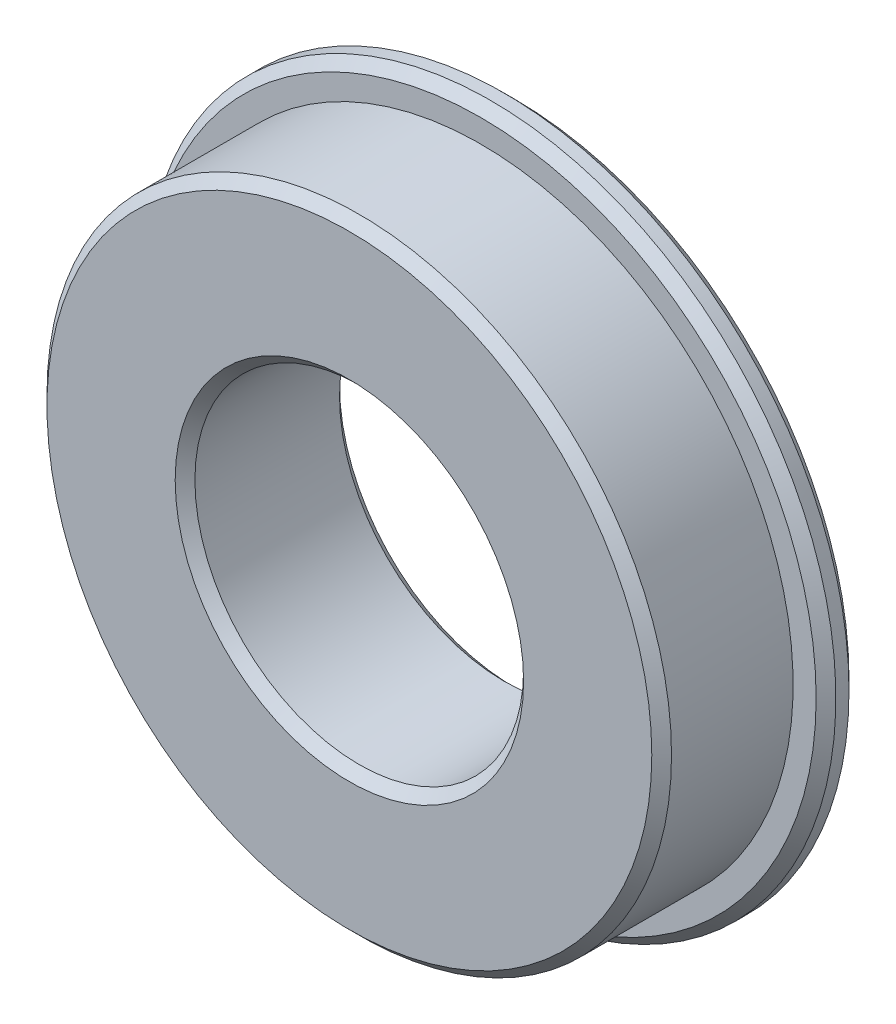
ISO-10303-21;
HEADER;
FILE_DESCRIPTION(('STEP AP214'),'2;1');
FILE_NAME('part.step','',(''),(''),'','','');
FILE_SCHEMA(('AUTOMOTIVE_DESIGN { 1 0 10303 214 1 1 1 1 }'));
ENDSEC;
DATA;
#1=APPLICATION_CONTEXT('core data for automotive mechanical design processes');
#2=APPLICATION_PROTOCOL_DEFINITION('international standard','automotive_design',2000,#1);
#3=PRODUCT_CONTEXT('',#1,'mechanical');
#4=PRODUCT('Part','Part','',(#3));
#5=PRODUCT_RELATED_PRODUCT_CATEGORY('part','',(#4));
#6=PRODUCT_DEFINITION_FORMATION('','',#4);
#7=PRODUCT_DEFINITION_CONTEXT('part definition',#1,'design');
#8=PRODUCT_DEFINITION('design','',#6,#7);
#9=PRODUCT_DEFINITION_SHAPE('','',#8);
#10=(LENGTH_UNIT() NAMED_UNIT(*) SI_UNIT(.MILLI.,.METRE.));
#11=(NAMED_UNIT(*) PLANE_ANGLE_UNIT() SI_UNIT($,.RADIAN.));
#12=(NAMED_UNIT(*) SI_UNIT($,.STERADIAN.) SOLID_ANGLE_UNIT());
#13=UNCERTAINTY_MEASURE_WITH_UNIT(LENGTH_MEASURE(1.E-05),#10,'distance_accuracy_value','');
#14=(GEOMETRIC_REPRESENTATION_CONTEXT(3) GLOBAL_UNCERTAINTY_ASSIGNED_CONTEXT((#13)) GLOBAL_UNIT_ASSIGNED_CONTEXT((#10,
#11,#12)) REPRESENTATION_CONTEXT('',''));
#15=CARTESIAN_POINT('',(0.,0.,0.));
#16=DIRECTION('',(0.,0.,1.));
#17=DIRECTION('',(1.,0.,0.));
#18=AXIS2_PLACEMENT_3D('',#15,#16,#17);
#19=CARTESIAN_POINT('',(0.,0.,5.));
#20=DIRECTION('',(0.,0.,-1.));
#21=DIRECTION('',(-1.,0.,0.));
#22=AXIS2_PLACEMENT_3D('',#19,#20,#21);
#23=CYLINDRICAL_SURFACE('',#22,9.5);
#24=CARTESIAN_POINT('',(0.,0.,4.7));
#25=DIRECTION('',(0.,0.,1.));
#26=DIRECTION('',(1.,0.,0.));
#27=AXIS2_PLACEMENT_3D('',#24,#25,#26);
#28=CIRCLE('',#27,9.5);
#29=CARTESIAN_POINT('',(9.5,0.,4.7));
#30=VERTEX_POINT('',#29);
#31=EDGE_CURVE('E40',#30,#30,#28,.F.);
#32=ORIENTED_EDGE('',*,*,#31,.T.);
#33=EDGE_LOOP('',(#32));
#34=FACE_BOUND('',#33,.T.);
#35=CARTESIAN_POINT('',(0.,0.,1.));
#36=DIRECTION('',(0.,0.,-1.));
#37=DIRECTION('',(-1.,0.,0.));
#38=AXIS2_PLACEMENT_3D('',#35,#36,#37);
#39=CIRCLE('',#38,9.5);
#40=CARTESIAN_POINT('',(-9.5,0.,1.));
#41=VERTEX_POINT('',#40);
#42=EDGE_CURVE('E71',#41,#41,#39,.T.);
#43=ORIENTED_EDGE('',*,*,#42,.F.);
#44=EDGE_LOOP('',(#43));
#45=FACE_BOUND('',#44,.T.);
#46=ADVANCED_FACE('F32',(#34,#45),#23,.T.);
#47=CARTESIAN_POINT('',(0.,0.,5.));
#48=DIRECTION('',(0.,0.,1.));
#49=DIRECTION('',(1.,0.,0.));
#50=AXIS2_PLACEMENT_3D('',#47,#48,#49);
#51=PLANE('',#50);
#52=CARTESIAN_POINT('',(0.,0.,5.));
#53=DIRECTION('',(0.,0.,1.));
#54=DIRECTION('',(1.,0.,0.));
#55=AXIS2_PLACEMENT_3D('',#52,#53,#54);
#56=CIRCLE('',#55,5.3);
#57=CARTESIAN_POINT('',(5.3,0.,5.));
#58=VERTEX_POINT('',#57);
#59=EDGE_CURVE('E59',#58,#58,#56,.F.);
#60=ORIENTED_EDGE('',*,*,#59,.T.);
#61=EDGE_LOOP('',(#60));
#62=FACE_BOUND('',#61,.T.);
#63=CARTESIAN_POINT('',(0.,0.,5.));
#64=DIRECTION('',(0.,0.,1.));
#65=DIRECTION('',(1.,0.,0.));
#66=AXIS2_PLACEMENT_3D('',#63,#64,#65);
#67=CIRCLE('',#66,9.2);
#68=CARTESIAN_POINT('',(9.2,0.,5.));
#69=VERTEX_POINT('',#68);
#70=EDGE_CURVE('E62',#69,#69,#67,.T.);
#71=ORIENTED_EDGE('',*,*,#70,.T.);
#72=EDGE_LOOP('',(#71));
#73=FACE_BOUND('',#72,.T.);
#74=ADVANCED_FACE('F78',(#62,#73),#51,.T.);
#75=CARTESIAN_POINT('',(0.,0.,0.));
#76=DIRECTION('',(0.,0.,1.));
#77=DIRECTION('',(1.,0.,0.));
#78=AXIS2_PLACEMENT_3D('',#75,#76,#77);
#79=PLANE('',#78);
#80=CARTESIAN_POINT('',(0.,0.,0.));
#81=DIRECTION('',(0.,0.,1.));
#82=DIRECTION('',(1.,0.,0.));
#83=AXIS2_PLACEMENT_3D('',#80,#81,#82);
#84=CIRCLE('',#83,5.30000000000001);
#85=CARTESIAN_POINT('',(5.30000000000001,0.,0.));
#86=VERTEX_POINT('',#85);
#87=EDGE_CURVE('E53',#86,#86,#84,.T.);
#88=ORIENTED_EDGE('',*,*,#87,.T.);
#89=EDGE_LOOP('',(#88));
#90=FACE_BOUND('',#89,.T.);
#91=CARTESIAN_POINT('',(0.,0.,0.));
#92=DIRECTION('',(0.,0.,1.));
#93=DIRECTION('',(1.,0.,0.));
#94=AXIS2_PLACEMENT_3D('',#91,#92,#93);
#95=CIRCLE('',#94,10.2);
#96=CARTESIAN_POINT('',(10.2,0.,0.));
#97=VERTEX_POINT('',#96);
#98=EDGE_CURVE('E56',#97,#97,#95,.F.);
#99=ORIENTED_EDGE('',*,*,#98,.T.);
#100=EDGE_LOOP('',(#99));
#101=FACE_BOUND('',#100,.T.);
#102=ADVANCED_FACE('F83',(#90,#101),#79,.F.);
#103=CARTESIAN_POINT('',(0.,0.,5.));
#104=DIRECTION('',(0.,0.,-1.));
#105=DIRECTION('',(-1.,0.,0.));
#106=AXIS2_PLACEMENT_3D('',#103,#104,#105);
#107=CYLINDRICAL_SURFACE('',#106,5.);
#108=CARTESIAN_POINT('',(0.,0.,4.7));
#109=DIRECTION('',(0.,0.,1.));
#110=DIRECTION('',(1.,0.,0.));
#111=AXIS2_PLACEMENT_3D('',#108,#109,#110);
#112=CIRCLE('',#111,5.);
#113=CARTESIAN_POINT('',(5.,0.,4.7));
#114=VERTEX_POINT('',#113);
#115=EDGE_CURVE('E65',#114,#114,#112,.T.);
#116=ORIENTED_EDGE('',*,*,#115,.T.);
#117=EDGE_LOOP('',(#116));
#118=FACE_BOUND('',#117,.T.);
#119=CARTESIAN_POINT('',(0.,0.,0.300000000000006));
#120=DIRECTION('',(0.,0.,1.));
#121=DIRECTION('',(1.,0.,0.));
#122=AXIS2_PLACEMENT_3D('',#119,#120,#121);
#123=CIRCLE('',#122,5.);
#124=CARTESIAN_POINT('',(5.,0.,0.300000000000006));
#125=VERTEX_POINT('',#124);
#126=EDGE_CURVE('E68',#125,#125,#123,.F.);
#127=ORIENTED_EDGE('',*,*,#126,.T.);
#128=EDGE_LOOP('',(#127));
#129=FACE_BOUND('',#128,.T.);
#130=ADVANCED_FACE('F128',(#118,#129),#107,.F.);
#131=CARTESIAN_POINT('',(0.,0.,1.));
#132=DIRECTION('',(0.,0.,-1.));
#133=DIRECTION('',(-1.,0.,0.));
#134=AXIS2_PLACEMENT_3D('',#131,#132,#133);
#135=CYLINDRICAL_SURFACE('',#134,10.5);
#136=CARTESIAN_POINT('',(0.,0.,0.300000000000002));
#137=DIRECTION('',(0.,0.,1.));
#138=DIRECTION('',(1.,0.,0.));
#139=AXIS2_PLACEMENT_3D('',#136,#137,#138);
#140=CIRCLE('',#139,10.5);
#141=CARTESIAN_POINT('',(10.5,0.,0.300000000000002));
#142=VERTEX_POINT('',#141);
#143=EDGE_CURVE('E44',#142,#142,#140,.T.);
#144=ORIENTED_EDGE('',*,*,#143,.T.);
#145=EDGE_LOOP('',(#144));
#146=FACE_BOUND('',#145,.T.);
#147=CARTESIAN_POINT('',(0.,0.,0.699999999999997));
#148=DIRECTION('',(0.,0.,-1.));
#149=DIRECTION('',(-1.,0.,0.));
#150=AXIS2_PLACEMENT_3D('',#147,#148,#149);
#151=CIRCLE('',#150,10.5);
#152=CARTESIAN_POINT('',(-10.5,0.,0.699999999999997));
#153=VERTEX_POINT('',#152);
#154=EDGE_CURVE('E48',#153,#153,#151,.T.);
#155=ORIENTED_EDGE('',*,*,#154,.T.);
#156=EDGE_LOOP('',(#155));
#157=FACE_BOUND('',#156,.T.);
#158=ADVANCED_FACE('F126',(#146,#157),#135,.T.);
#159=CARTESIAN_POINT('',(0.,0.,1.));
#160=DIRECTION('',(0.,0.,-1.));
#161=DIRECTION('',(-1.,0.,0.));
#162=AXIS2_PLACEMENT_3D('',#159,#160,#161);
#163=PLANE('',#162);
#164=CARTESIAN_POINT('',(0.,0.,1.));
#165=DIRECTION('',(0.,0.,-1.));
#166=DIRECTION('',(-1.,0.,0.));
#167=AXIS2_PLACEMENT_3D('',#164,#165,#166);
#168=CIRCLE('',#167,10.2);
#169=CARTESIAN_POINT('',(-10.2,0.,1.));
#170=VERTEX_POINT('',#169);
#171=EDGE_CURVE('E10',#170,#170,#168,.F.);
#172=ORIENTED_EDGE('',*,*,#171,.T.);
#173=EDGE_LOOP('',(#172));
#174=FACE_BOUND('',#173,.T.);
#175=ORIENTED_EDGE('',*,*,#42,.T.);
#176=EDGE_LOOP('',(#175));
#177=FACE_BOUND('',#176,.T.);
#178=ADVANCED_FACE('F75',(#174,#177),#163,.F.);
#179=CARTESIAN_POINT('',(0.,0.,4.7));
#180=DIRECTION('',(0.,0.,1.));
#181=DIRECTION('',(1.,0.,0.));
#182=AXIS2_PLACEMENT_3D('',#179,#180,#181);
#183=CONICAL_SURFACE('',#182,5.,0.785398163397443);
#184=ORIENTED_EDGE('',*,*,#59,.F.);
#185=EDGE_LOOP('',(#184));
#186=FACE_BOUND('',#185,.T.);
#187=ORIENTED_EDGE('',*,*,#115,.F.);
#188=EDGE_LOOP('',(#187));
#189=FACE_BOUND('',#188,.T.);
#190=ADVANCED_FACE('F89',(#186,#189),#183,.F.);
#191=CARTESIAN_POINT('',(0.,0.,0.));
#192=DIRECTION('',(0.,0.,-1.));
#193=DIRECTION('',(-1.,0.,0.));
#194=AXIS2_PLACEMENT_3D('',#191,#192,#193);
#195=CONICAL_SURFACE('',#194,5.30000000000001,0.785398163397448);
#196=ORIENTED_EDGE('',*,*,#126,.F.);
#197=EDGE_LOOP('',(#196));
#198=FACE_BOUND('',#197,.T.);
#199=ORIENTED_EDGE('',*,*,#87,.F.);
#200=EDGE_LOOP('',(#199));
#201=FACE_BOUND('',#200,.T.);
#202=ADVANCED_FACE('F95',(#198,#201),#195,.F.);
#203=CARTESIAN_POINT('',(0.,0.,0.));
#204=DIRECTION('',(0.,0.,1.));
#205=DIRECTION('',(1.,0.,0.));
#206=AXIS2_PLACEMENT_3D('',#203,#204,#205);
#207=CONICAL_SURFACE('',#206,10.2,0.78539816339744);
#208=ORIENTED_EDGE('',*,*,#143,.F.);
#209=EDGE_LOOP('',(#208));
#210=FACE_BOUND('',#209,.T.);
#211=ORIENTED_EDGE('',*,*,#98,.F.);
#212=EDGE_LOOP('',(#211));
#213=FACE_BOUND('',#212,.T.);
#214=ADVANCED_FACE('F102',(#210,#213),#207,.T.);
#215=CARTESIAN_POINT('',(0.,0.,5.));
#216=DIRECTION('',(0.,0.,-1.));
#217=DIRECTION('',(-1.,0.,0.));
#218=AXIS2_PLACEMENT_3D('',#215,#216,#217);
#219=CONICAL_SURFACE('',#218,9.2,0.785398163397448);
#220=ORIENTED_EDGE('',*,*,#31,.F.);
#221=EDGE_LOOP('',(#220));
#222=FACE_BOUND('',#221,.T.);
#223=ORIENTED_EDGE('',*,*,#70,.F.);
#224=EDGE_LOOP('',(#223));
#225=FACE_BOUND('',#224,.T.);
#226=ADVANCED_FACE('F108',(#222,#225),#219,.T.);
#227=CARTESIAN_POINT('',(0.,0.,0.699999999999997));
#228=DIRECTION('',(0.,0.,-1.));
#229=DIRECTION('',(-1.,0.,0.));
#230=AXIS2_PLACEMENT_3D('',#227,#228,#229);
#231=CONICAL_SURFACE('',#230,10.5,0.785398163397454);
#232=ORIENTED_EDGE('',*,*,#171,.F.);
#233=EDGE_LOOP('',(#232));
#234=FACE_BOUND('',#233,.T.);
#235=ORIENTED_EDGE('',*,*,#154,.F.);
#236=EDGE_LOOP('',(#235));
#237=FACE_BOUND('',#236,.T.);
#238=ADVANCED_FACE('F35',(#234,#237),#231,.T.);
#239=CLOSED_SHELL('',(#46,#74,#102,#130,#158,#178,#190,#202,#214,#226,#238));
#240=MANIFOLD_SOLID_BREP('B2',#239);
#241=ADVANCED_BREP_SHAPE_REPRESENTATION('',(#18,#240),#14);
#242=SHAPE_DEFINITION_REPRESENTATION(#9,#241);
ENDSEC;
END-ISO-10303-21;
